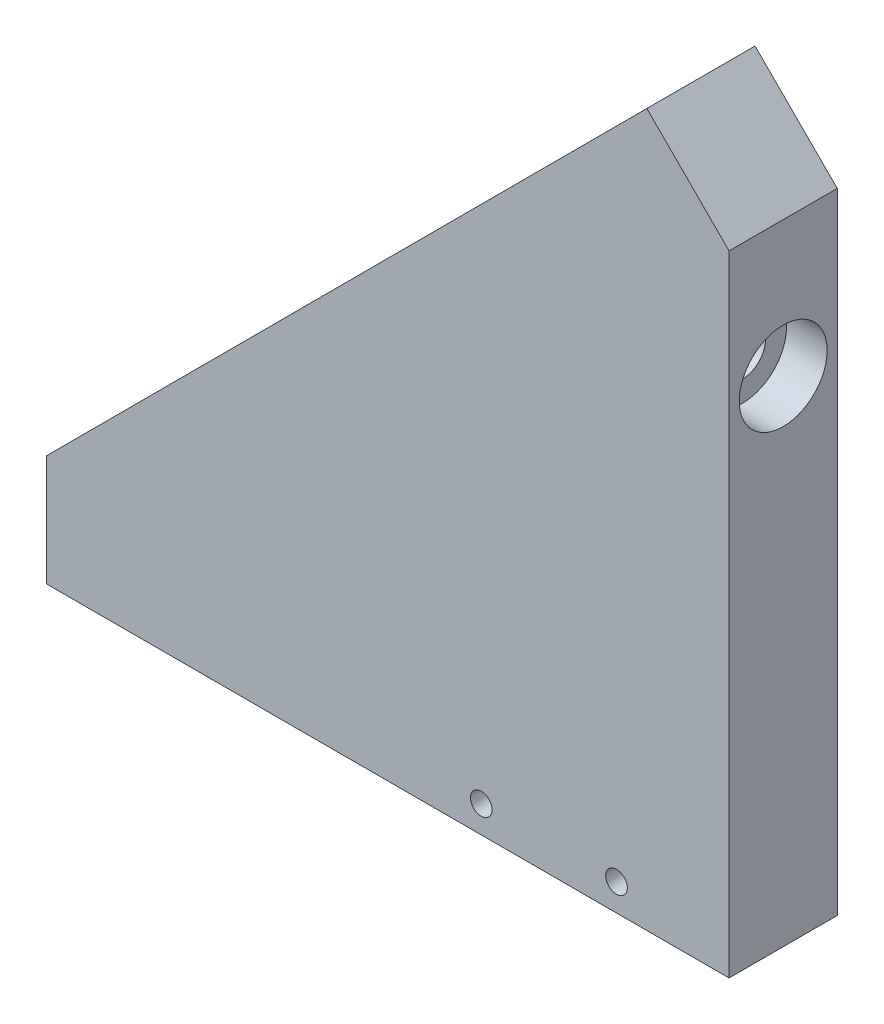
ISO-10303-21;
HEADER;
FILE_DESCRIPTION(('STEP AP214'),'2;1');
FILE_NAME('part.step','',(''),(''),'','','');
FILE_SCHEMA(('AUTOMOTIVE_DESIGN { 1 0 10303 214 1 1 1 1 }'));
ENDSEC;
DATA;
#1=APPLICATION_CONTEXT('core data for automotive mechanical design processes');
#2=APPLICATION_PROTOCOL_DEFINITION('international standard','automotive_design',2000,#1);
#3=PRODUCT_CONTEXT('',#1,'mechanical');
#4=PRODUCT('Part','Part','',(#3));
#5=PRODUCT_RELATED_PRODUCT_CATEGORY('part','',(#4));
#6=PRODUCT_DEFINITION_FORMATION('','',#4);
#7=PRODUCT_DEFINITION_CONTEXT('part definition',#1,'design');
#8=PRODUCT_DEFINITION('design','',#6,#7);
#9=PRODUCT_DEFINITION_SHAPE('','',#8);
#10=(LENGTH_UNIT() NAMED_UNIT(*) SI_UNIT(.MILLI.,.METRE.));
#11=(NAMED_UNIT(*) PLANE_ANGLE_UNIT() SI_UNIT($,.RADIAN.));
#12=(NAMED_UNIT(*) SI_UNIT($,.STERADIAN.) SOLID_ANGLE_UNIT());
#13=UNCERTAINTY_MEASURE_WITH_UNIT(LENGTH_MEASURE(1.E-05),#10,'distance_accuracy_value','');
#14=(GEOMETRIC_REPRESENTATION_CONTEXT(3) GLOBAL_UNCERTAINTY_ASSIGNED_CONTEXT((#13)) GLOBAL_UNIT_ASSIGNED_CONTEXT((#10,
#11,#12)) REPRESENTATION_CONTEXT('',''));
#15=CARTESIAN_POINT('',(0.,0.,0.));
#16=DIRECTION('',(0.,0.,1.));
#17=DIRECTION('',(1.,0.,0.));
#18=AXIS2_PLACEMENT_3D('',#15,#16,#17);
#19=CARTESIAN_POINT('',(43.0840368947245,64.5860213091515,4.));
#20=DIRECTION('',(0.707459642969067,-0.706753743230328,0.));
#21=DIRECTION('',(0.706753743230328,0.707459642969067,0.));
#22=AXIS2_PLACEMENT_3D('',#19,#20,#21);
#23=PLANE('',#22);
#24=CARTESIAN_POINT('',(5.78157432702778,27.2463013532441,0.));
#25=DIRECTION('',(-0.707459642969066,0.706753743230328,0.));
#26=DIRECTION('',(-0.706753743230328,-0.707459642969066,0.));
#27=AXIS2_PLACEMENT_3D('',#24,#25,#26);
#28=CIRCLE('',#27,1.5);
#29=CARTESIAN_POINT('',(4.72144371218229,26.1851118887905,0.));
#30=VERTEX_POINT('',#29);
#31=EDGE_CURVE('E102',#30,#30,#28,.T.);
#32=ORIENTED_EDGE('',*,*,#31,.F.);
#33=EDGE_LOOP('',(#32));
#34=FACE_BOUND('',#33,.T.);
#35=CARTESIAN_POINT('',(27.0176213287725,48.5035587414551,0.));
#36=DIRECTION('',(0.707459642969067,-0.706753743230328,0.));
#37=DIRECTION('',(0.706753743230328,0.707459642969067,0.));
#38=AXIS2_PLACEMENT_3D('',#35,#36,#37);
#39=ELLIPSE('',#38,2.40296392436668,1.7);
#40=CARTESIAN_POINT('',(28.7159250771661,50.2035587414551,0.));
#41=VERTEX_POINT('',#40);
#42=EDGE_CURVE('E42',#41,#41,#39,.T.);
#43=ORIENTED_EDGE('',*,*,#42,.T.);
#44=EDGE_LOOP('',(#43));
#45=FACE_BOUND('',#44,.T.);
#46=DIRECTION('',(-0.706753743230328,-0.707459642969067,0.));
#47=VECTOR('',#46,1.);
#48=CARTESIAN_POINT('',(43.0840368947245,64.5860213091515,4.));
#49=LINE('',#48,#47);
#50=CARTESIAN_POINT('',(43.080509157768,64.5824900487208,4.));
#51=VERTEX_POINT('',#50);
#52=CARTESIAN_POINT('',(-1.2859631052755,20.1717049235535,4.));
#53=VERTEX_POINT('',#52);
#54=EDGE_CURVE('E47',#51,#53,#49,.T.);
#55=ORIENTED_EDGE('',*,*,#54,.F.);
#56=DIRECTION('',(0.,0.,-1.));
#57=VECTOR('',#56,1.);
#58=CARTESIAN_POINT('',(43.080509157768,64.5824900487208,4.));
#59=LINE('',#58,#57);
#60=CARTESIAN_POINT('',(43.080509157768,64.5824900487208,-4.));
#61=VERTEX_POINT('',#60);
#62=EDGE_CURVE('E145',#51,#61,#59,.T.);
#63=ORIENTED_EDGE('',*,*,#62,.T.);
#64=DIRECTION('',(-0.706753743230328,-0.707459642969067,0.));
#65=VECTOR('',#64,1.);
#66=CARTESIAN_POINT('',(43.0840368947245,64.5860213091515,-4.));
#67=LINE('',#66,#65);
#68=CARTESIAN_POINT('',(-1.2859631052755,20.1717049235535,-4.));
#69=VERTEX_POINT('',#68);
#70=EDGE_CURVE('E161',#61,#69,#67,.T.);
#71=ORIENTED_EDGE('',*,*,#70,.T.);
#72=DIRECTION('',(0.,0.,-1.));
#73=VECTOR('',#72,1.);
#74=CARTESIAN_POINT('',(-1.2859631052755,20.1717049235535,4.));
#75=LINE('',#74,#73);
#76=EDGE_CURVE('E11',#53,#69,#75,.T.);
#77=ORIENTED_EDGE('',*,*,#76,.F.);
#78=EDGE_LOOP('',(#55,#63,#71,#77));
#79=FACE_BOUND('',#78,.T.);
#80=ADVANCED_FACE('F39',(#34,#45,#79),#23,.F.);
#81=CARTESIAN_POINT('',(0.,0.,4.));
#82=DIRECTION('',(0.,0.,1.));
#83=DIRECTION('',(1.,0.,0.));
#84=AXIS2_PLACEMENT_3D('',#81,#82,#83);
#85=PLANE('',#84);
#86=DIRECTION('',(0.,1.,0.));
#87=VECTOR('',#86,1.);
#88=CARTESIAN_POINT('',(-1.2859631052755,20.1717049235535,4.));
#89=LINE('',#88,#87);
#90=CARTESIAN_POINT('',(-1.2859631052755,11.9492423558568,4.));
#91=VERTEX_POINT('',#90);
#92=EDGE_CURVE('E112',#91,#53,#89,.T.);
#93=ORIENTED_EDGE('',*,*,#92,.F.);
#94=DIRECTION('',(-1.,0.,0.));
#95=VECTOR('',#94,1.);
#96=CARTESIAN_POINT('',(-8.36055953496616,11.9492423558568,4.));
#97=LINE('',#96,#95);
#98=CARTESIAN_POINT('',(49.1594404650338,11.9492423558568,4.));
#99=VERTEX_POINT('',#98);
#100=EDGE_CURVE('E158',#99,#91,#97,.T.);
#101=ORIENTED_EDGE('',*,*,#100,.F.);
#102=DIRECTION('',(0.,-1.,0.));
#103=VECTOR('',#102,1.);
#104=CARTESIAN_POINT('',(49.1594404650338,71.6535587414548,4.));
#105=LINE('',#104,#103);
#106=CARTESIAN_POINT('',(49.1594404650338,58.5035587414551,4.));
#107=VERTEX_POINT('',#106);
#108=EDGE_CURVE('E148',#107,#99,#105,.T.);
#109=ORIENTED_EDGE('',*,*,#108,.F.);
#110=DIRECTION('',(0.707106781186556,-0.707106781186539,0.));
#111=VECTOR('',#110,1.);
#112=CARTESIAN_POINT('',(36.0094404650338,71.6535587414548,4.));
#113=LINE('',#112,#111);
#114=EDGE_CURVE('E61',#51,#107,#113,.T.);
#115=ORIENTED_EDGE('',*,*,#114,.F.);
#116=ORIENTED_EDGE('',*,*,#54,.T.);
#117=EDGE_LOOP('',(#93,#101,#109,#115,#116));
#118=FACE_BOUND('',#117,.T.);
#119=CARTESIAN_POINT('',(30.8394404650338,13.9492423558568,4.));
#120=DIRECTION('',(0.,0.,1.));
#121=DIRECTION('',(1.,0.,0.));
#122=AXIS2_PLACEMENT_3D('',#119,#120,#121);
#123=CIRCLE('',#122,0.800000000000002);
#124=CARTESIAN_POINT('',(31.6394404650338,13.9492423558568,4.));
#125=VERTEX_POINT('',#124);
#126=EDGE_CURVE('E118',#125,#125,#123,.T.);
#127=ORIENTED_EDGE('',*,*,#126,.F.);
#128=EDGE_LOOP('',(#127));
#129=FACE_BOUND('',#128,.T.);
#130=CARTESIAN_POINT('',(40.8394404650338,13.9492423558568,4.));
#131=DIRECTION('',(0.,0.,1.));
#132=DIRECTION('',(1.,0.,0.));
#133=AXIS2_PLACEMENT_3D('',#130,#131,#132);
#134=CIRCLE('',#133,0.800000000000002);
#135=CARTESIAN_POINT('',(41.6394404650338,13.9492423558568,4.));
#136=VERTEX_POINT('',#135);
#137=EDGE_CURVE('E124',#136,#136,#134,.T.);
#138=ORIENTED_EDGE('',*,*,#137,.F.);
#139=EDGE_LOOP('',(#138));
#140=FACE_BOUND('',#139,.T.);
#141=ADVANCED_FACE('F180',(#118,#129,#140),#85,.T.);
#142=CARTESIAN_POINT('',(0.,0.,-4.));
#143=DIRECTION('',(0.,0.,1.));
#144=DIRECTION('',(1.,0.,0.));
#145=AXIS2_PLACEMENT_3D('',#142,#143,#144);
#146=PLANE('',#145);
#147=DIRECTION('',(1.,0.,0.));
#148=VECTOR('',#147,1.);
#149=CARTESIAN_POINT('',(-8.36055953496616,11.9492423558568,-4.));
#150=LINE('',#149,#148);
#151=CARTESIAN_POINT('',(-1.2859631052755,11.9492423558568,-4.));
#152=VERTEX_POINT('',#151);
#153=CARTESIAN_POINT('',(49.1594404650338,11.9492423558568,-4.));
#154=VERTEX_POINT('',#153);
#155=EDGE_CURVE('E156',#152,#154,#150,.T.);
#156=ORIENTED_EDGE('',*,*,#155,.F.);
#157=DIRECTION('',(0.,1.,0.));
#158=VECTOR('',#157,1.);
#159=CARTESIAN_POINT('',(-1.2859631052755,20.1717049235535,-4.));
#160=LINE('',#159,#158);
#161=EDGE_CURVE('E53',#152,#69,#160,.T.);
#162=ORIENTED_EDGE('',*,*,#161,.T.);
#163=ORIENTED_EDGE('',*,*,#70,.F.);
#164=DIRECTION('',(0.707106781186556,-0.707106781186539,0.));
#165=VECTOR('',#164,1.);
#166=CARTESIAN_POINT('',(36.0094404650338,71.6535587414548,-4.));
#167=LINE('',#166,#165);
#168=CARTESIAN_POINT('',(49.1594404650338,58.5035587414551,-4.));
#169=VERTEX_POINT('',#168);
#170=EDGE_CURVE('E139',#61,#169,#167,.T.);
#171=ORIENTED_EDGE('',*,*,#170,.T.);
#172=DIRECTION('',(0.,-1.,0.));
#173=VECTOR('',#172,1.);
#174=CARTESIAN_POINT('',(49.1594404650338,71.6535587414548,-4.));
#175=LINE('',#174,#173);
#176=EDGE_CURVE('E149',#169,#154,#175,.T.);
#177=ORIENTED_EDGE('',*,*,#176,.T.);
#178=EDGE_LOOP('',(#156,#162,#163,#171,#177));
#179=FACE_BOUND('',#178,.T.);
#180=ADVANCED_FACE('F171',(#179),#146,.F.);
#181=CARTESIAN_POINT('',(0.,11.9492423558568,0.));
#182=DIRECTION('',(0.,1.,0.));
#183=DIRECTION('',(-1.,0.,0.));
#184=AXIS2_PLACEMENT_3D('',#181,#182,#183);
#185=PLANE('',#184);
#186=ORIENTED_EDGE('',*,*,#100,.T.);
#187=DIRECTION('',(0.,0.,1.));
#188=VECTOR('',#187,1.);
#189=CARTESIAN_POINT('',(-1.2859631052755,11.9492423558568,-4.));
#190=LINE('',#189,#188);
#191=EDGE_CURVE('E115',#152,#91,#190,.T.);
#192=ORIENTED_EDGE('',*,*,#191,.F.);
#193=ORIENTED_EDGE('',*,*,#155,.T.);
#194=DIRECTION('',(0.,0.,1.));
#195=VECTOR('',#194,1.);
#196=CARTESIAN_POINT('',(49.1594404650338,11.9492423558568,-4.));
#197=LINE('',#196,#195);
#198=EDGE_CURVE('E152',#154,#99,#197,.T.);
#199=ORIENTED_EDGE('',*,*,#198,.T.);
#200=EDGE_LOOP('',(#186,#192,#193,#199));
#201=FACE_BOUND('',#200,.T.);
#202=ADVANCED_FACE('F175',(#201),#185,.F.);
#203=CARTESIAN_POINT('',(49.1594404650338,71.6535587414548,-4.));
#204=DIRECTION('',(-1.,0.,0.));
#205=DIRECTION('',(0.,-1.,0.));
#206=AXIS2_PLACEMENT_3D('',#203,#204,#205);
#207=PLANE('',#206);
#208=CARTESIAN_POINT('',(49.1594404650338,48.5035587414551,0.));
#209=DIRECTION('',(1.,0.,0.));
#210=DIRECTION('',(0.,0.,-1.));
#211=AXIS2_PLACEMENT_3D('',#208,#209,#210);
#212=CIRCLE('',#211,3.25);
#213=CARTESIAN_POINT('',(49.1594404650338,48.5035587414551,-3.25));
#214=VERTEX_POINT('',#213);
#215=EDGE_CURVE('E130',#214,#214,#212,.T.);
#216=ORIENTED_EDGE('',*,*,#215,.F.);
#217=EDGE_LOOP('',(#216));
#218=FACE_BOUND('',#217,.T.);
#219=ORIENTED_EDGE('',*,*,#176,.F.);
#220=DIRECTION('',(0.,0.,1.));
#221=VECTOR('',#220,1.);
#222=CARTESIAN_POINT('',(49.1594404650338,58.5035587414551,-4.));
#223=LINE('',#222,#221);
#224=EDGE_CURVE('E142',#169,#107,#223,.T.);
#225=ORIENTED_EDGE('',*,*,#224,.T.);
#226=ORIENTED_EDGE('',*,*,#108,.T.);
#227=ORIENTED_EDGE('',*,*,#198,.F.);
#228=EDGE_LOOP('',(#219,#225,#226,#227));
#229=FACE_BOUND('',#228,.T.);
#230=ADVANCED_FACE('F184',(#218,#229),#207,.F.);
#231=CARTESIAN_POINT('',(36.0094404650338,71.6535587414548,-4.));
#232=DIRECTION('',(-0.707106781186539,-0.707106781186556,0.));
#233=DIRECTION('',(0.707106781186556,-0.707106781186539,0.));
#234=AXIS2_PLACEMENT_3D('',#231,#232,#233);
#235=PLANE('',#234);
#236=ORIENTED_EDGE('',*,*,#114,.T.);
#237=ORIENTED_EDGE('',*,*,#224,.F.);
#238=ORIENTED_EDGE('',*,*,#170,.F.);
#239=ORIENTED_EDGE('',*,*,#62,.F.);
#240=EDGE_LOOP('',(#236,#237,#238,#239));
#241=FACE_BOUND('',#240,.T.);
#242=ADVANCED_FACE('F185',(#241),#235,.F.);
#243=CARTESIAN_POINT('',(49.1594404650338,48.5035587414551,0.));
#244=DIRECTION('',(1.,0.,0.));
#245=DIRECTION('',(0.,0.,-1.));
#246=AXIS2_PLACEMENT_3D('',#243,#244,#245);
#247=CYLINDRICAL_SURFACE('',#246,1.7);
#248=CARTESIAN_POINT('',(46.1594404650338,48.5035587414551,0.));
#249=DIRECTION('',(1.,0.,0.));
#250=DIRECTION('',(0.,0.,-1.));
#251=AXIS2_PLACEMENT_3D('',#248,#249,#250);
#252=CIRCLE('',#251,1.70000000000001);
#253=CARTESIAN_POINT('',(46.1594404650338,48.5035587414551,-1.70000000000001));
#254=VERTEX_POINT('',#253);
#255=EDGE_CURVE('E136',#254,#254,#252,.T.);
#256=ORIENTED_EDGE('',*,*,#255,.T.);
#257=EDGE_LOOP('',(#256));
#258=FACE_BOUND('',#257,.T.);
#259=ORIENTED_EDGE('',*,*,#42,.F.);
#260=EDGE_LOOP('',(#259));
#261=FACE_BOUND('',#260,.T.);
#262=ADVANCED_FACE('F187',(#258,#261),#247,.F.);
#263=CARTESIAN_POINT('',(46.1594404650338,50.2035587414551,0.));
#264=DIRECTION('',(-1.,0.,0.));
#265=DIRECTION('',(0.,0.,1.));
#266=AXIS2_PLACEMENT_3D('',#263,#264,#265);
#267=PLANE('',#266);
#268=ORIENTED_EDGE('',*,*,#255,.F.);
#269=EDGE_LOOP('',(#268));
#270=FACE_BOUND('',#269,.T.);
#271=CARTESIAN_POINT('',(46.1594404650338,48.5035587414551,0.));
#272=DIRECTION('',(1.,0.,0.));
#273=DIRECTION('',(0.,0.,-1.));
#274=AXIS2_PLACEMENT_3D('',#271,#272,#273);
#275=CIRCLE('',#274,3.25);
#276=CARTESIAN_POINT('',(46.1594404650338,48.5035587414551,-3.25));
#277=VERTEX_POINT('',#276);
#278=EDGE_CURVE('E133',#277,#277,#275,.T.);
#279=ORIENTED_EDGE('',*,*,#278,.T.);
#280=EDGE_LOOP('',(#279));
#281=FACE_BOUND('',#280,.T.);
#282=ADVANCED_FACE('F193',(#270,#281),#267,.F.);
#283=CARTESIAN_POINT('',(49.1594404650338,48.5035587414551,0.));
#284=DIRECTION('',(1.,0.,0.));
#285=DIRECTION('',(0.,0.,-1.));
#286=AXIS2_PLACEMENT_3D('',#283,#284,#285);
#287=CYLINDRICAL_SURFACE('',#286,3.25);
#288=ORIENTED_EDGE('',*,*,#278,.F.);
#289=EDGE_LOOP('',(#288));
#290=FACE_BOUND('',#289,.T.);
#291=ORIENTED_EDGE('',*,*,#215,.T.);
#292=EDGE_LOOP('',(#291));
#293=FACE_BOUND('',#292,.T.);
#294=ADVANCED_FACE('F239',(#290,#293),#287,.F.);
#295=CARTESIAN_POINT('',(40.8394404650338,13.9492423558568,-3.));
#296=DIRECTION('',(0.,0.,1.));
#297=DIRECTION('',(1.,0.,0.));
#298=AXIS2_PLACEMENT_3D('',#295,#296,#297);
#299=CONICAL_SURFACE('',#298,0.799999999999995,1.02974425867665);
#300=CARTESIAN_POINT('',(40.8394404650338,13.9492423558568,-3.48068849522205));
#301=VERTEX_POINT('',#300);
#302=VERTEX_LOOP('',#301);
#303=FACE_BOUND('',#302,.T.);
#304=CARTESIAN_POINT('',(40.8394404650338,13.9492423558568,-3.));
#305=DIRECTION('',(0.,0.,1.));
#306=DIRECTION('',(1.,0.,0.));
#307=AXIS2_PLACEMENT_3D('',#304,#305,#306);
#308=CIRCLE('',#307,0.799999999999995);
#309=CARTESIAN_POINT('',(41.6394404650338,13.9492423558568,-3.));
#310=VERTEX_POINT('',#309);
#311=EDGE_CURVE('E127',#310,#310,#308,.T.);
#312=ORIENTED_EDGE('',*,*,#311,.T.);
#313=EDGE_LOOP('',(#312));
#314=FACE_BOUND('',#313,.T.);
#315=ADVANCED_FACE('F235',(#303,#314),#299,.F.);
#316=CARTESIAN_POINT('',(40.8394404650338,13.9492423558568,4.));
#317=DIRECTION('',(0.,0.,1.));
#318=DIRECTION('',(1.,0.,0.));
#319=AXIS2_PLACEMENT_3D('',#316,#317,#318);
#320=CYLINDRICAL_SURFACE('',#319,0.799999999999999);
#321=ORIENTED_EDGE('',*,*,#311,.F.);
#322=EDGE_LOOP('',(#321));
#323=FACE_BOUND('',#322,.T.);
#324=ORIENTED_EDGE('',*,*,#137,.T.);
#325=EDGE_LOOP('',(#324));
#326=FACE_BOUND('',#325,.T.);
#327=ADVANCED_FACE('F231',(#323,#326),#320,.F.);
#328=CARTESIAN_POINT('',(30.8394404650338,13.9492423558568,-3.));
#329=DIRECTION('',(0.,0.,1.));
#330=DIRECTION('',(1.,0.,0.));
#331=AXIS2_PLACEMENT_3D('',#328,#329,#330);
#332=CONICAL_SURFACE('',#331,0.799999999999995,1.02974425867665);
#333=CARTESIAN_POINT('',(30.8394404650338,13.9492423558568,-3.48068849522205));
#334=VERTEX_POINT('',#333);
#335=VERTEX_LOOP('',#334);
#336=FACE_BOUND('',#335,.T.);
#337=CARTESIAN_POINT('',(30.8394404650338,13.9492423558568,-3.));
#338=DIRECTION('',(0.,0.,1.));
#339=DIRECTION('',(1.,0.,0.));
#340=AXIS2_PLACEMENT_3D('',#337,#338,#339);
#341=CIRCLE('',#340,0.799999999999995);
#342=CARTESIAN_POINT('',(31.6394404650338,13.9492423558568,-3.));
#343=VERTEX_POINT('',#342);
#344=EDGE_CURVE('E121',#343,#343,#341,.T.);
#345=ORIENTED_EDGE('',*,*,#344,.T.);
#346=EDGE_LOOP('',(#345));
#347=FACE_BOUND('',#346,.T.);
#348=ADVANCED_FACE('F227',(#336,#347),#332,.F.);
#349=CARTESIAN_POINT('',(30.8394404650338,13.9492423558568,4.));
#350=DIRECTION('',(0.,0.,1.));
#351=DIRECTION('',(1.,0.,0.));
#352=AXIS2_PLACEMENT_3D('',#349,#350,#351);
#353=CYLINDRICAL_SURFACE('',#352,0.799999999999999);
#354=ORIENTED_EDGE('',*,*,#344,.F.);
#355=EDGE_LOOP('',(#354));
#356=FACE_BOUND('',#355,.T.);
#357=ORIENTED_EDGE('',*,*,#126,.T.);
#358=EDGE_LOOP('',(#357));
#359=FACE_BOUND('',#358,.T.);
#360=ADVANCED_FACE('F220',(#356,#359),#353,.F.);
#361=CARTESIAN_POINT('',(-1.2859631052755,20.1717049235535,-4.));
#362=DIRECTION('',(1.,0.,0.));
#363=DIRECTION('',(0.,1.,0.));
#364=AXIS2_PLACEMENT_3D('',#361,#362,#363);
#365=PLANE('',#364);
#366=CARTESIAN_POINT('',(-1.2859631052755,15.9492423558568,0.));
#367=DIRECTION('',(-1.,0.,0.));
#368=DIRECTION('',(0.,0.,1.));
#369=AXIS2_PLACEMENT_3D('',#366,#367,#368);
#370=CIRCLE('',#369,1.24999999999999);
#371=CARTESIAN_POINT('',(-1.2859631052755,15.9492423558568,1.24999999999999));
#372=VERTEX_POINT('',#371);
#373=EDGE_CURVE('E103',#372,#372,#370,.T.);
#374=ORIENTED_EDGE('',*,*,#373,.F.);
#375=EDGE_LOOP('',(#374));
#376=FACE_BOUND('',#375,.T.);
#377=ORIENTED_EDGE('',*,*,#92,.T.);
#378=ORIENTED_EDGE('',*,*,#76,.T.);
#379=ORIENTED_EDGE('',*,*,#161,.F.);
#380=ORIENTED_EDGE('',*,*,#191,.T.);
#381=EDGE_LOOP('',(#377,#378,#379,#380));
#382=FACE_BOUND('',#381,.T.);
#383=ADVANCED_FACE('F178',(#376,#382),#365,.F.);
#384=CARTESIAN_POINT('',(9.67260236335765,23.3591557654773,0.));
#385=DIRECTION('',(-0.707459642969067,0.706753743230329,0.));
#386=DIRECTION('',(-0.706753743230328,-0.707459642969066,0.));
#387=AXIS2_PLACEMENT_3D('',#384,#385,#386);
#388=CYLINDRICAL_SURFACE('',#387,1.5);
#389=CARTESIAN_POINT('',(9.67260236335765,23.3591557654773,0.));
#390=DIRECTION('',(-0.707459642969066,0.706753743230328,0.));
#391=DIRECTION('',(-0.706753743230328,-0.707459642969066,0.));
#392=AXIS2_PLACEMENT_3D('',#389,#390,#391);
#393=CIRCLE('',#392,1.5);
#394=CARTESIAN_POINT('',(8.61247174851216,22.2979663010237,0.));
#395=VERTEX_POINT('',#394);
#396=EDGE_CURVE('E106',#395,#395,#393,.T.);
#397=ORIENTED_EDGE('',*,*,#396,.F.);
#398=EDGE_LOOP('',(#397));
#399=FACE_BOUND('',#398,.T.);
#400=ORIENTED_EDGE('',*,*,#31,.T.);
#401=EDGE_LOOP('',(#400));
#402=FACE_BOUND('',#401,.T.);
#403=ADVANCED_FACE('F210',(#399,#402),#388,.F.);
#404=CARTESIAN_POINT('',(9.67260236335765,23.3591557654773,0.));
#405=DIRECTION('',(-0.707459642969066,0.706753743230328,0.));
#406=DIRECTION('',(-0.706753743230328,-0.707459642969066,0.));
#407=AXIS2_PLACEMENT_3D('',#404,#405,#406);
#408=PLANE('',#407);
#409=ORIENTED_EDGE('',*,*,#396,.T.);
#410=EDGE_LOOP('',(#409));
#411=FACE_BOUND('',#410,.T.);
#412=ADVANCED_FACE('F96',(#411),#408,.T.);
#413=CARTESIAN_POINT('',(7.21403689472451,15.9492423558568,0.));
#414=DIRECTION('',(-1.,0.,0.));
#415=DIRECTION('',(0.,0.,1.));
#416=AXIS2_PLACEMENT_3D('',#413,#414,#415);
#417=CONICAL_SURFACE('',#416,1.24999999999999,1.02974425867665);
#418=CARTESIAN_POINT('',(7.96511266850895,15.9492423558568,0.));
#419=VERTEX_POINT('',#418);
#420=VERTEX_LOOP('',#419);
#421=FACE_BOUND('',#420,.T.);
#422=CARTESIAN_POINT('',(7.21403689472451,15.9492423558568,0.));
#423=DIRECTION('',(-1.,0.,0.));
#424=DIRECTION('',(0.,0.,1.));
#425=AXIS2_PLACEMENT_3D('',#422,#423,#424);
#426=CIRCLE('',#425,1.24999999999999);
#427=CARTESIAN_POINT('',(7.21403689472451,15.9492423558568,1.24999999999999));
#428=VERTEX_POINT('',#427);
#429=EDGE_CURVE('E100',#428,#428,#426,.T.);
#430=ORIENTED_EDGE('',*,*,#429,.T.);
#431=EDGE_LOOP('',(#430));
#432=FACE_BOUND('',#431,.T.);
#433=ADVANCED_FACE('F92',(#421,#432),#417,.F.);
#434=CARTESIAN_POINT('',(-1.2859631052755,15.9492423558568,0.));
#435=DIRECTION('',(-1.,0.,0.));
#436=DIRECTION('',(0.,0.,1.));
#437=AXIS2_PLACEMENT_3D('',#434,#435,#436);
#438=CYLINDRICAL_SURFACE('',#437,1.24999999999999);
#439=ORIENTED_EDGE('',*,*,#429,.F.);
#440=EDGE_LOOP('',(#439));
#441=FACE_BOUND('',#440,.T.);
#442=ORIENTED_EDGE('',*,*,#373,.T.);
#443=EDGE_LOOP('',(#442));
#444=FACE_BOUND('',#443,.T.);
#445=ADVANCED_FACE('F95',(#441,#444),#438,.F.);
#446=CLOSED_SHELL('',(#80,#141,#180,#202,#230,#242,#262,#282,#294,#315,#327,#348,#360,#383,#403,
#412,#433,#445));
#447=MANIFOLD_SOLID_BREP('B2',#446);
#448=ADVANCED_BREP_SHAPE_REPRESENTATION('',(#18,#447),#14);
#449=SHAPE_DEFINITION_REPRESENTATION(#9,#448);
ENDSEC;
END-ISO-10303-21;
